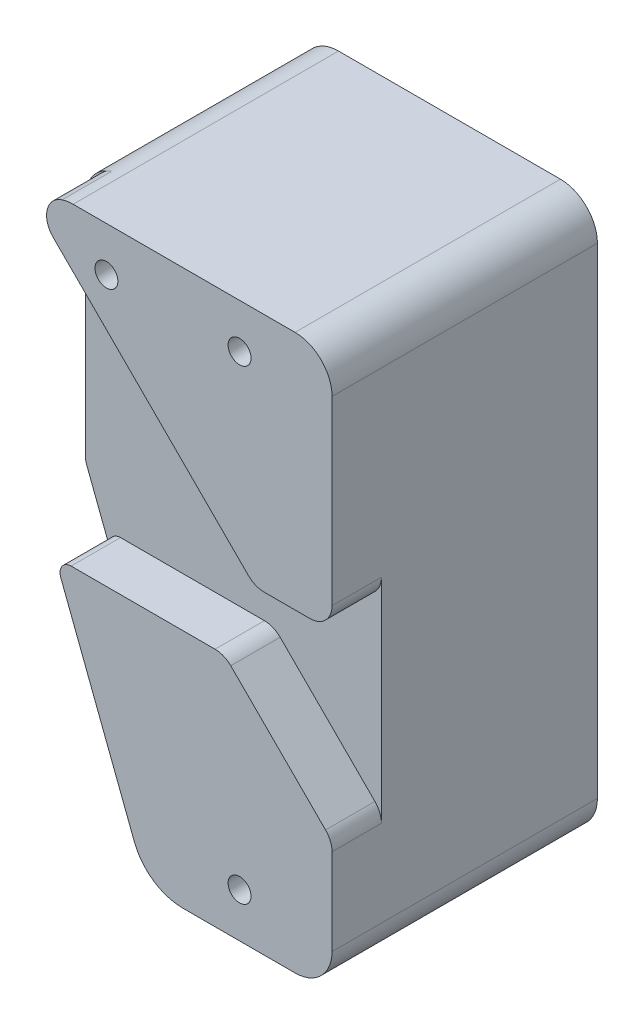
ISO-10303-21;
HEADER;
FILE_DESCRIPTION(('STEP AP214'),'2;1');
FILE_NAME('part.step','',(''),(''),'','','');
FILE_SCHEMA(('AUTOMOTIVE_DESIGN { 1 0 10303 214 1 1 1 1 }'));
ENDSEC;
DATA;
#1=APPLICATION_CONTEXT('core data for automotive mechanical design processes');
#2=APPLICATION_PROTOCOL_DEFINITION('international standard','automotive_design',2000,#1);
#3=PRODUCT_CONTEXT('',#1,'mechanical');
#4=PRODUCT('Part','Part','',(#3));
#5=PRODUCT_RELATED_PRODUCT_CATEGORY('part','',(#4));
#6=PRODUCT_DEFINITION_FORMATION('','',#4);
#7=PRODUCT_DEFINITION_CONTEXT('part definition',#1,'design');
#8=PRODUCT_DEFINITION('design','',#6,#7);
#9=PRODUCT_DEFINITION_SHAPE('','',#8);
#10=(LENGTH_UNIT() NAMED_UNIT(*) SI_UNIT(.MILLI.,.METRE.));
#11=(NAMED_UNIT(*) PLANE_ANGLE_UNIT() SI_UNIT($,.RADIAN.));
#12=(NAMED_UNIT(*) SI_UNIT($,.STERADIAN.) SOLID_ANGLE_UNIT());
#13=UNCERTAINTY_MEASURE_WITH_UNIT(LENGTH_MEASURE(1.E-05),#10,'distance_accuracy_value','');
#14=(GEOMETRIC_REPRESENTATION_CONTEXT(3) GLOBAL_UNCERTAINTY_ASSIGNED_CONTEXT((#13)) GLOBAL_UNIT_ASSIGNED_CONTEXT((#10,
#11,#12)) REPRESENTATION_CONTEXT('',''));
#15=CARTESIAN_POINT('',(0.,0.,0.));
#16=DIRECTION('',(0.,0.,1.));
#17=DIRECTION('',(1.,0.,0.));
#18=AXIS2_PLACEMENT_3D('',#15,#16,#17);
#19=CARTESIAN_POINT('',(-15.,0.,2.85));
#20=DIRECTION('',(1.,0.,0.));
#21=DIRECTION('',(0.,0.,-1.));
#22=AXIS2_PLACEMENT_3D('',#19,#20,#21);
#23=PLANE('',#22);
#24=DIRECTION('',(0.,-1.,0.));
#25=VECTOR('',#24,1.);
#26=CARTESIAN_POINT('',(-15.,0.,2.85));
#27=LINE('',#26,#25);
#28=CARTESIAN_POINT('',(-15.,70.,2.85000000000001));
#29=VERTEX_POINT('',#28);
#30=CARTESIAN_POINT('',(-15.,39.5,2.85));
#31=VERTEX_POINT('',#30);
#32=EDGE_CURVE('E335',#29,#31,#27,.T.);
#33=ORIENTED_EDGE('',*,*,#32,.F.);
#34=DIRECTION('',(0.,0.,-1.));
#35=VECTOR('',#34,1.);
#36=CARTESIAN_POINT('',(-15.,70.,2.85));
#37=LINE('',#36,#35);
#38=CARTESIAN_POINT('',(-15.,70.,-26.35));
#39=VERTEX_POINT('',#38);
#40=EDGE_CURVE('E341',#29,#39,#37,.T.);
#41=ORIENTED_EDGE('',*,*,#40,.T.);
#42=DIRECTION('',(0.,1.,0.));
#43=VECTOR('',#42,1.);
#44=CARTESIAN_POINT('',(-15.,39.5,-26.35));
#45=LINE('',#44,#43);
#46=CARTESIAN_POINT('',(-15.,39.5,-26.35));
#47=VERTEX_POINT('',#46);
#48=EDGE_CURVE('E240',#47,#39,#45,.T.);
#49=ORIENTED_EDGE('',*,*,#48,.F.);
#50=DIRECTION('',(0.,0.,-1.));
#51=VECTOR('',#50,1.);
#52=CARTESIAN_POINT('',(-15.,39.5,2.85));
#53=LINE('',#52,#51);
#54=EDGE_CURVE('E201',#47,#31,#53,.F.);
#55=ORIENTED_EDGE('',*,*,#54,.T.);
#56=EDGE_LOOP('',(#33,#41,#49,#55));
#57=FACE_BOUND('',#56,.T.);
#58=ADVANCED_FACE('F42',(#57),#23,.F.);
#59=CARTESIAN_POINT('',(0.,42.5,6.35));
#60=DIRECTION('',(0.,1.,0.));
#61=DIRECTION('',(-1.,0.,0.));
#62=AXIS2_PLACEMENT_3D('',#59,#60,#61);
#63=PLANE('',#62);
#64=DIRECTION('',(1.,0.,0.));
#65=VECTOR('',#64,1.);
#66=CARTESIAN_POINT('',(0.,42.5,2.85));
#67=LINE('',#66,#65);
#68=CARTESIAN_POINT('',(15.8137084989848,42.5,2.85));
#69=VERTEX_POINT('',#68);
#70=CARTESIAN_POINT('',(22.,42.5,2.85));
#71=VERTEX_POINT('',#70);
#72=EDGE_CURVE('E331',#69,#71,#67,.T.);
#73=ORIENTED_EDGE('',*,*,#72,.T.);
#74=DIRECTION('',(0.,0.,1.));
#75=VECTOR('',#74,1.);
#76=CARTESIAN_POINT('',(22.,42.5,6.35));
#77=LINE('',#76,#75);
#78=CARTESIAN_POINT('',(22.,42.5,9.525));
#79=VERTEX_POINT('',#78);
#80=EDGE_CURVE('E380',#71,#79,#77,.T.);
#81=ORIENTED_EDGE('',*,*,#80,.T.);
#82=DIRECTION('',(1.,0.,0.));
#83=VECTOR('',#82,1.);
#84=CARTESIAN_POINT('',(0.,42.5,9.525));
#85=LINE('',#84,#83);
#86=CARTESIAN_POINT('',(15.8137084989848,42.5,9.525));
#87=VERTEX_POINT('',#86);
#88=EDGE_CURVE('E323',#87,#79,#85,.T.);
#89=ORIENTED_EDGE('',*,*,#88,.F.);
#90=DIRECTION('',(0.,0.,-1.));
#91=VECTOR('',#90,1.);
#92=CARTESIAN_POINT('',(15.8137084989848,42.5,6.35));
#93=LINE('',#92,#91);
#94=EDGE_CURVE('E376',#87,#69,#93,.T.);
#95=ORIENTED_EDGE('',*,*,#94,.T.);
#96=EDGE_LOOP('',(#73,#81,#89,#95));
#97=FACE_BOUND('',#96,.T.);
#98=ADVANCED_FACE('F487',(#97),#63,.F.);
#99=CARTESIAN_POINT('',(0.,75.,2.85));
#100=DIRECTION('',(0.,-1.,0.));
#101=DIRECTION('',(0.,0.,-1.));
#102=AXIS2_PLACEMENT_3D('',#99,#100,#101);
#103=PLANE('',#102);
#104=DIRECTION('',(0.,0.,-1.));
#105=VECTOR('',#104,1.);
#106=CARTESIAN_POINT('',(20.,75.,2.85));
#107=LINE('',#106,#105);
#108=CARTESIAN_POINT('',(20.,75.,9.525));
#109=VERTEX_POINT('',#108);
#110=CARTESIAN_POINT('',(20.,75.,-26.35));
#111=VERTEX_POINT('',#110);
#112=EDGE_CURVE('E344',#109,#111,#107,.T.);
#113=ORIENTED_EDGE('',*,*,#112,.T.);
#114=DIRECTION('',(1.,0.,0.));
#115=VECTOR('',#114,1.);
#116=CARTESIAN_POINT('',(-10.,75.,-26.35));
#117=LINE('',#116,#115);
#118=CARTESIAN_POINT('',(-10.,75.,-26.35));
#119=VERTEX_POINT('',#118);
#120=EDGE_CURVE('E248',#119,#111,#117,.T.);
#121=ORIENTED_EDGE('',*,*,#120,.F.);
#122=DIRECTION('',(0.,0.,-1.));
#123=VECTOR('',#122,1.);
#124=CARTESIAN_POINT('',(-10.,75.,2.85));
#125=LINE('',#124,#123);
#126=CARTESIAN_POINT('',(-10.,75.,9.525));
#127=VERTEX_POINT('',#126);
#128=EDGE_CURVE('E347',#119,#127,#125,.F.);
#129=ORIENTED_EDGE('',*,*,#128,.T.);
#130=DIRECTION('',(-1.,0.,0.));
#131=VECTOR('',#130,1.);
#132=CARTESIAN_POINT('',(0.,75.,9.525));
#133=LINE('',#132,#131);
#134=EDGE_CURVE('E315',#109,#127,#133,.T.);
#135=ORIENTED_EDGE('',*,*,#134,.F.);
#136=EDGE_LOOP('',(#113,#121,#129,#135));
#137=FACE_BOUND('',#136,.T.);
#138=ADVANCED_FACE('F529',(#137),#103,.F.);
#139=CARTESIAN_POINT('',(0.,0.,2.85));
#140=DIRECTION('',(0.,1.,0.));
#141=DIRECTION('',(0.,0.,1.));
#142=AXIS2_PLACEMENT_3D('',#139,#140,#141);
#143=PLANE('',#142);
#144=DIRECTION('',(1.,0.,0.));
#145=VECTOR('',#144,1.);
#146=CARTESIAN_POINT('',(0.,0.,9.525));
#147=LINE('',#146,#145);
#148=CARTESIAN_POINT('',(4.81332293887137,0.,9.525));
#149=VERTEX_POINT('',#148);
#150=CARTESIAN_POINT('',(20.,0.,9.525));
#151=VERTEX_POINT('',#150);
#152=EDGE_CURVE('E299',#149,#151,#147,.T.);
#153=ORIENTED_EDGE('',*,*,#152,.F.);
#154=DIRECTION('',(0.,0.,-1.));
#155=VECTOR('',#154,1.);
#156=CARTESIAN_POINT('',(4.81332293887137,0.,-6.35));
#157=LINE('',#156,#155);
#158=CARTESIAN_POINT('',(4.81332293887137,0.,-26.35));
#159=VERTEX_POINT('',#158);
#160=EDGE_CURVE('E208',#149,#159,#157,.T.);
#161=ORIENTED_EDGE('',*,*,#160,.T.);
#162=DIRECTION('',(-1.,0.,0.));
#163=VECTOR('',#162,1.);
#164=CARTESIAN_POINT('',(20.,0.,-26.35));
#165=LINE('',#164,#163);
#166=CARTESIAN_POINT('',(20.,0.,-26.35));
#167=VERTEX_POINT('',#166);
#168=EDGE_CURVE('E205',#167,#159,#165,.T.);
#169=ORIENTED_EDGE('',*,*,#168,.F.);
#170=DIRECTION('',(0.,0.,-1.));
#171=VECTOR('',#170,1.);
#172=CARTESIAN_POINT('',(20.,0.,2.85));
#173=LINE('',#172,#171);
#174=EDGE_CURVE('E191',#167,#151,#173,.F.);
#175=ORIENTED_EDGE('',*,*,#174,.T.);
#176=EDGE_LOOP('',(#153,#161,#169,#175));
#177=FACE_BOUND('',#176,.T.);
#178=ADVANCED_FACE('F206',(#177),#143,.F.);
#179=CARTESIAN_POINT('',(25.,0.,2.85));
#180=DIRECTION('',(-1.,0.,0.));
#181=DIRECTION('',(0.,0.,1.));
#182=AXIS2_PLACEMENT_3D('',#179,#180,#181);
#183=PLANE('',#182);
#184=DIRECTION('',(0.,1.,0.));
#185=VECTOR('',#184,1.);
#186=CARTESIAN_POINT('',(25.,0.,9.525));
#187=LINE('',#186,#185);
#188=CARTESIAN_POINT('',(25.,45.5,9.525));
#189=VERTEX_POINT('',#188);
#190=CARTESIAN_POINT('',(25.,70.,9.525));
#191=VERTEX_POINT('',#190);
#192=EDGE_CURVE('E308',#189,#191,#187,.T.);
#193=ORIENTED_EDGE('',*,*,#192,.F.);
#194=DIRECTION('',(0.,0.,1.));
#195=VECTOR('',#194,1.);
#196=CARTESIAN_POINT('',(25.,45.5,2.85));
#197=LINE('',#196,#195);
#198=CARTESIAN_POINT('',(25.,45.5,2.85));
#199=VERTEX_POINT('',#198);
#200=EDGE_CURVE('E397',#189,#199,#197,.F.);
#201=ORIENTED_EDGE('',*,*,#200,.T.);
#202=DIRECTION('',(0.,1.,0.));
#203=VECTOR('',#202,1.);
#204=CARTESIAN_POINT('',(25.,0.,2.85));
#205=LINE('',#204,#203);
#206=CARTESIAN_POINT('',(25.,16.6862915010152,2.85));
#207=VERTEX_POINT('',#206);
#208=EDGE_CURVE('E338',#207,#199,#205,.T.);
#209=ORIENTED_EDGE('',*,*,#208,.F.);
#210=DIRECTION('',(0.,0.,1.));
#211=VECTOR('',#210,1.);
#212=CARTESIAN_POINT('',(25.,16.6862915010152,2.85));
#213=LINE('',#212,#211);
#214=CARTESIAN_POINT('',(25.,16.6862915010152,9.525));
#215=VERTEX_POINT('',#214);
#216=EDGE_CURVE('E393',#207,#215,#213,.T.);
#217=ORIENTED_EDGE('',*,*,#216,.T.);
#218=DIRECTION('',(0.,1.,0.));
#219=VECTOR('',#218,1.);
#220=CARTESIAN_POINT('',(25.,0.,9.525));
#221=LINE('',#220,#219);
#222=CARTESIAN_POINT('',(25.,5.,9.525));
#223=VERTEX_POINT('',#222);
#224=EDGE_CURVE('E304',#223,#215,#221,.T.);
#225=ORIENTED_EDGE('',*,*,#224,.F.);
#226=DIRECTION('',(0.,0.,-1.));
#227=VECTOR('',#226,1.);
#228=CARTESIAN_POINT('',(25.,5.,2.85));
#229=LINE('',#228,#227);
#230=CARTESIAN_POINT('',(25.,5.,-26.35));
#231=VERTEX_POINT('',#230);
#232=EDGE_CURVE('E202',#223,#231,#229,.T.);
#233=ORIENTED_EDGE('',*,*,#232,.T.);
#234=DIRECTION('',(0.,-1.,0.));
#235=VECTOR('',#234,1.);
#236=CARTESIAN_POINT('',(25.,70.,-26.35));
#237=LINE('',#236,#235);
#238=CARTESIAN_POINT('',(25.,70.,-26.35));
#239=VERTEX_POINT('',#238);
#240=EDGE_CURVE('E220',#239,#231,#237,.T.);
#241=ORIENTED_EDGE('',*,*,#240,.F.);
#242=DIRECTION('',(0.,0.,-1.));
#243=VECTOR('',#242,1.);
#244=CARTESIAN_POINT('',(25.,70.,2.85));
#245=LINE('',#244,#243);
#246=EDGE_CURVE('E350',#239,#191,#245,.F.);
#247=ORIENTED_EDGE('',*,*,#246,.T.);
#248=EDGE_LOOP('',(#193,#201,#209,#217,#225,#233,#241,#247));
#249=FACE_BOUND('',#248,.T.);
#250=ADVANCED_FACE('F481',(#249),#183,.F.);
#251=CARTESIAN_POINT('',(0.,0.,2.85));
#252=DIRECTION('',(0.,0.,1.));
#253=DIRECTION('',(1.,0.,0.));
#254=AXIS2_PLACEMENT_3D('',#251,#252,#253);
#255=PLANE('',#254);
#256=CARTESIAN_POINT('',(12.5,37.5,2.85));
#257=DIRECTION('',(0.,0.,1.));
#258=DIRECTION('',(1.,0.,0.));
#259=AXIS2_PLACEMENT_3D('',#256,#257,#258);
#260=CIRCLE('',#259,1.55);
#261=CARTESIAN_POINT('',(14.05,37.5,2.85));
#262=VERTEX_POINT('',#261);
#263=EDGE_CURVE('E269',#262,#262,#260,.T.);
#264=ORIENTED_EDGE('',*,*,#263,.F.);
#265=EDGE_LOOP('',(#264));
#266=FACE_BOUND('',#265,.T.);
#267=DIRECTION('',(-0.35794111613384,0.933744160560515,0.));
#268=VECTOR('',#267,1.);
#269=CARTESIAN_POINT('',(0.,0.,2.85));
#270=LINE('',#269,#268);
#271=CARTESIAN_POINT('',(-11.6777081954385,30.4630883257992,2.85));
#272=VERTEX_POINT('',#271);
#273=CARTESIAN_POINT('',(-14.867488321121,38.7841177677323,2.85));
#274=VERTEX_POINT('',#273);
#275=EDGE_CURVE('E57',#272,#274,#270,.T.);
#276=ORIENTED_EDGE('',*,*,#275,.F.);
#277=CARTESIAN_POINT('',(-10.2770919545977,31.,2.85));
#278=DIRECTION('',(0.,0.,1.));
#279=DIRECTION('',(1.,0.,0.));
#280=AXIS2_PLACEMENT_3D('',#277,#278,#279);
#281=CIRCLE('',#280,1.5);
#282=CARTESIAN_POINT('',(-10.2770919545977,32.5,2.85));
#283=VERTEX_POINT('',#282);
#284=EDGE_CURVE('E12',#272,#283,#281,.F.);
#285=ORIENTED_EDGE('',*,*,#284,.T.);
#286=DIRECTION('',(-1.,0.,0.));
#287=VECTOR('',#286,1.);
#288=CARTESIAN_POINT('',(0.,32.5,2.85));
#289=LINE('',#288,#287);
#290=CARTESIAN_POINT('',(9.18629150101523,32.5,2.85));
#291=VERTEX_POINT('',#290);
#292=EDGE_CURVE('E327',#291,#283,#289,.T.);
#293=ORIENTED_EDGE('',*,*,#292,.F.);
#294=CARTESIAN_POINT('',(9.18629150101523,29.5,2.85));
#295=DIRECTION('',(0.,0.,1.));
#296=DIRECTION('',(1.,0.,0.));
#297=AXIS2_PLACEMENT_3D('',#294,#295,#296);
#298=CIRCLE('',#297,3.);
#299=CARTESIAN_POINT('',(11.3076118445749,31.6213203435596,2.85000000000001));
#300=VERTEX_POINT('',#299);
#301=EDGE_CURVE('E434',#291,#300,#298,.F.);
#302=ORIENTED_EDGE('',*,*,#301,.T.);
#303=DIRECTION('',(-0.707106781186547,0.707106781186548,0.));
#304=VECTOR('',#303,1.);
#305=CARTESIAN_POINT('',(21.4644660940673,21.4644660940672,2.85000000000001));
#306=LINE('',#305,#304);
#307=CARTESIAN_POINT('',(24.1213203435596,18.8076118445749,2.85000000000001));
#308=VERTEX_POINT('',#307);
#309=EDGE_CURVE('E292',#308,#300,#306,.T.);
#310=ORIENTED_EDGE('',*,*,#309,.F.);
#311=CARTESIAN_POINT('',(22.,16.6862915010152,2.85));
#312=DIRECTION('',(0.,0.,1.));
#313=DIRECTION('',(1.,0.,0.));
#314=AXIS2_PLACEMENT_3D('',#311,#312,#313);
#315=CIRCLE('',#314,3.);
#316=EDGE_CURVE('E430',#308,#207,#315,.F.);
#317=ORIENTED_EDGE('',*,*,#316,.T.);
#318=ORIENTED_EDGE('',*,*,#208,.T.);
#319=CARTESIAN_POINT('',(22.,45.5,2.85));
#320=DIRECTION('',(0.,0.,1.));
#321=DIRECTION('',(1.,0.,0.));
#322=AXIS2_PLACEMENT_3D('',#319,#320,#321);
#323=CIRCLE('',#322,3.);
#324=EDGE_CURVE('E427',#199,#71,#323,.F.);
#325=ORIENTED_EDGE('',*,*,#324,.T.);
#326=ORIENTED_EDGE('',*,*,#72,.F.);
#327=CARTESIAN_POINT('',(15.8137084989848,45.5,2.85));
#328=DIRECTION('',(0.,0.,1.));
#329=DIRECTION('',(1.,0.,0.));
#330=AXIS2_PLACEMENT_3D('',#327,#328,#329);
#331=CIRCLE('',#330,3.);
#332=CARTESIAN_POINT('',(13.6923881554251,43.3786796564404,2.85000000000001));
#333=VERTEX_POINT('',#332);
#334=EDGE_CURVE('E437',#69,#333,#331,.F.);
#335=ORIENTED_EDGE('',*,*,#334,.T.);
#336=DIRECTION('',(0.707106781186548,-0.707106781186548,0.));
#337=VECTOR('',#336,1.);
#338=CARTESIAN_POINT('',(28.5355339059327,28.5355339059327,2.85000000000001));
#339=LINE('',#338,#337);
#340=CARTESIAN_POINT('',(-12.7168807597926,69.787948571658,2.85000000000001));
#341=VERTEX_POINT('',#340);
#342=EDGE_CURVE('E285',#341,#333,#339,.T.);
#343=ORIENTED_EDGE('',*,*,#342,.F.);
#344=CARTESIAN_POINT('',(-10.5955604162329,71.9092689152177,2.85));
#345=DIRECTION('',(0.,0.,1.));
#346=DIRECTION('',(1.,0.,0.));
#347=AXIS2_PLACEMENT_3D('',#344,#345,#346);
#348=CIRCLE('',#347,3.);
#349=CARTESIAN_POINT('',(-11.4889010405823,74.7731722880442,2.85000000000001));
#350=VERTEX_POINT('',#349);
#351=EDGE_CURVE('E440',#341,#350,#348,.F.);
#352=ORIENTED_EDGE('',*,*,#351,.T.);
#353=CARTESIAN_POINT('',(-10.,70.,2.85000000000001));
#354=DIRECTION('',(0.,0.,1.));
#355=DIRECTION('',(1.,0.,0.));
#356=AXIS2_PLACEMENT_3D('',#353,#354,#355);
#357=CIRCLE('',#356,5.);
#358=EDGE_CURVE('E289',#29,#350,#357,.F.);
#359=ORIENTED_EDGE('',*,*,#358,.F.);
#360=ORIENTED_EDGE('',*,*,#32,.T.);
#361=CARTESIAN_POINT('',(-13.,39.5,2.85));
#362=DIRECTION('',(0.,0.,1.));
#363=DIRECTION('',(1.,0.,0.));
#364=AXIS2_PLACEMENT_3D('',#361,#362,#363);
#365=CIRCLE('',#364,2.);
#366=EDGE_CURVE('E359',#31,#274,#365,.T.);
#367=ORIENTED_EDGE('',*,*,#366,.T.);
#368=EDGE_LOOP('',(#276,#285,#293,#302,#310,#317,#318,#325,#326,#335,#343,#352,#359,#360,#367));
#369=FACE_BOUND('',#368,.T.);
#370=ADVANCED_FACE('F458',(#266,#369),#255,.T.);
#371=CARTESIAN_POINT('',(-10.,70.,2.85));
#372=DIRECTION('',(0.,0.,-1.));
#373=DIRECTION('',(-1.,0.,0.));
#374=AXIS2_PLACEMENT_3D('',#371,#372,#373);
#375=CYLINDRICAL_SURFACE('',#374,5.);
#376=ORIENTED_EDGE('',*,*,#358,.T.);
#377=DIRECTION('',(0.,0.,-1.));
#378=VECTOR('',#377,1.);
#379=CARTESIAN_POINT('',(-11.4889010405823,74.7731722880442,2.85));
#380=LINE('',#379,#378);
#381=CARTESIAN_POINT('',(-11.4889010405823,74.7731722880442,9.525));
#382=VERTEX_POINT('',#381);
#383=EDGE_CURVE('E423',#350,#382,#380,.F.);
#384=ORIENTED_EDGE('',*,*,#383,.T.);
#385=CARTESIAN_POINT('',(-10.,70.,9.525));
#386=DIRECTION('',(0.,0.,1.));
#387=DIRECTION('',(1.,0.,0.));
#388=AXIS2_PLACEMENT_3D('',#385,#386,#387);
#389=CIRCLE('',#388,5.);
#390=EDGE_CURVE('E319',#127,#382,#389,.T.);
#391=ORIENTED_EDGE('',*,*,#390,.F.);
#392=ORIENTED_EDGE('',*,*,#128,.F.);
#393=CARTESIAN_POINT('',(-10.,70.,-26.35));
#394=DIRECTION('',(0.,0.,-1.));
#395=DIRECTION('',(-1.,0.,0.));
#396=AXIS2_PLACEMENT_3D('',#393,#394,#395);
#397=CIRCLE('',#396,5.);
#398=EDGE_CURVE('E244',#39,#119,#397,.T.);
#399=ORIENTED_EDGE('',*,*,#398,.F.);
#400=ORIENTED_EDGE('',*,*,#40,.F.);
#401=EDGE_LOOP('',(#376,#384,#391,#392,#399,#400));
#402=FACE_BOUND('',#401,.T.);
#403=ADVANCED_FACE('F508',(#402),#375,.T.);
#404=CARTESIAN_POINT('',(20.,5.,2.85));
#405=DIRECTION('',(0.,0.,-1.));
#406=DIRECTION('',(-1.,0.,0.));
#407=AXIS2_PLACEMENT_3D('',#404,#405,#406);
#408=CYLINDRICAL_SURFACE('',#407,5.);
#409=ORIENTED_EDGE('',*,*,#232,.F.);
#410=CARTESIAN_POINT('',(20.,5.,9.525));
#411=DIRECTION('',(0.,0.,1.));
#412=DIRECTION('',(1.,0.,0.));
#413=AXIS2_PLACEMENT_3D('',#410,#411,#412);
#414=CIRCLE('',#413,5.);
#415=EDGE_CURVE('E197',#151,#223,#414,.T.);
#416=ORIENTED_EDGE('',*,*,#415,.F.);
#417=ORIENTED_EDGE('',*,*,#174,.F.);
#418=CARTESIAN_POINT('',(20.,5.,-26.35));
#419=DIRECTION('',(0.,0.,-1.));
#420=DIRECTION('',(-1.,0.,0.));
#421=AXIS2_PLACEMENT_3D('',#418,#419,#420);
#422=CIRCLE('',#421,5.);
#423=EDGE_CURVE('E195',#231,#167,#422,.T.);
#424=ORIENTED_EDGE('',*,*,#423,.F.);
#425=EDGE_LOOP('',(#409,#416,#417,#424));
#426=FACE_BOUND('',#425,.T.);
#427=ADVANCED_FACE('F193',(#426),#408,.T.);
#428=CARTESIAN_POINT('',(20.,70.,2.85));
#429=DIRECTION('',(0.,0.,-1.));
#430=DIRECTION('',(-1.,0.,0.));
#431=AXIS2_PLACEMENT_3D('',#428,#429,#430);
#432=CYLINDRICAL_SURFACE('',#431,5.);
#433=ORIENTED_EDGE('',*,*,#112,.F.);
#434=CARTESIAN_POINT('',(20.,70.,9.525));
#435=DIRECTION('',(0.,0.,1.));
#436=DIRECTION('',(1.,0.,0.));
#437=AXIS2_PLACEMENT_3D('',#434,#435,#436);
#438=CIRCLE('',#437,5.);
#439=EDGE_CURVE('E311',#191,#109,#438,.T.);
#440=ORIENTED_EDGE('',*,*,#439,.F.);
#441=ORIENTED_EDGE('',*,*,#246,.F.);
#442=CARTESIAN_POINT('',(20.,70.,-26.35));
#443=DIRECTION('',(0.,0.,-1.));
#444=DIRECTION('',(-1.,0.,0.));
#445=AXIS2_PLACEMENT_3D('',#442,#443,#444);
#446=CIRCLE('',#445,5.);
#447=EDGE_CURVE('E252',#111,#239,#446,.T.);
#448=ORIENTED_EDGE('',*,*,#447,.F.);
#449=EDGE_LOOP('',(#433,#440,#441,#448));
#450=FACE_BOUND('',#449,.T.);
#451=ADVANCED_FACE('F525',(#450),#432,.T.);
#452=CARTESIAN_POINT('',(-13.,39.5,2.85));
#453=DIRECTION('',(0.,0.,1.));
#454=DIRECTION('',(1.,0.,0.));
#455=AXIS2_PLACEMENT_3D('',#452,#453,#454);
#456=CYLINDRICAL_SURFACE('',#455,2.);
#457=DIRECTION('',(0.,0.,-1.));
#458=VECTOR('',#457,1.);
#459=CARTESIAN_POINT('',(-14.867488321121,38.7841177677323,46.4266552549781));
#460=LINE('',#459,#458);
#461=CARTESIAN_POINT('',(-14.867488321121,38.7841177677323,-26.35));
#462=VERTEX_POINT('',#461);
#463=EDGE_CURVE('E282',#274,#462,#460,.T.);
#464=ORIENTED_EDGE('',*,*,#463,.F.);
#465=ORIENTED_EDGE('',*,*,#366,.F.);
#466=ORIENTED_EDGE('',*,*,#54,.F.);
#467=CARTESIAN_POINT('',(-13.,39.5,-26.35));
#468=DIRECTION('',(0.,0.,-1.));
#469=DIRECTION('',(-1.,0.,0.));
#470=AXIS2_PLACEMENT_3D('',#467,#468,#469);
#471=CIRCLE('',#470,2.);
#472=EDGE_CURVE('E236',#462,#47,#471,.T.);
#473=ORIENTED_EDGE('',*,*,#472,.F.);
#474=EDGE_LOOP('',(#464,#465,#466,#473));
#475=FACE_BOUND('',#474,.T.);
#476=ADVANCED_FACE('F515',(#475),#456,.T.);
#477=CARTESIAN_POINT('',(0.,32.5,6.35));
#478=DIRECTION('',(0.,-1.,0.));
#479=DIRECTION('',(0.,0.,-1.));
#480=AXIS2_PLACEMENT_3D('',#477,#478,#479);
#481=PLANE('',#480);
#482=ORIENTED_EDGE('',*,*,#292,.T.);
#483=DIRECTION('',(0.,0.,1.));
#484=VECTOR('',#483,1.);
#485=CARTESIAN_POINT('',(-10.2770919545977,32.5,9.525));
#486=LINE('',#485,#484);
#487=CARTESIAN_POINT('',(-10.2770919545977,32.5,9.525));
#488=VERTEX_POINT('',#487);
#489=EDGE_CURVE('E444',#283,#488,#486,.T.);
#490=ORIENTED_EDGE('',*,*,#489,.T.);
#491=DIRECTION('',(-1.,0.,0.));
#492=VECTOR('',#491,1.);
#493=CARTESIAN_POINT('',(0.,32.5,9.525));
#494=LINE('',#493,#492);
#495=CARTESIAN_POINT('',(9.18629150101523,32.5,9.525));
#496=VERTEX_POINT('',#495);
#497=EDGE_CURVE('E296',#496,#488,#494,.T.);
#498=ORIENTED_EDGE('',*,*,#497,.F.);
#499=DIRECTION('',(0.,0.,-1.));
#500=VECTOR('',#499,1.);
#501=CARTESIAN_POINT('',(9.18629150101523,32.5,6.35));
#502=LINE('',#501,#500);
#503=EDGE_CURVE('E413',#496,#291,#502,.T.);
#504=ORIENTED_EDGE('',*,*,#503,.T.);
#505=EDGE_LOOP('',(#482,#490,#498,#504));
#506=FACE_BOUND('',#505,.T.);
#507=ADVANCED_FACE('F460',(#506),#481,.F.);
#508=CARTESIAN_POINT('',(0.,0.,9.525));
#509=DIRECTION('',(0.,0.,1.));
#510=DIRECTION('',(1.,0.,0.));
#511=AXIS2_PLACEMENT_3D('',#508,#509,#510);
#512=PLANE('',#511);
#513=CARTESIAN_POINT('',(-5.50000000000001,69.,9.525));
#514=DIRECTION('',(0.,0.,-1.));
#515=DIRECTION('',(-1.,0.,0.));
#516=AXIS2_PLACEMENT_3D('',#513,#514,#515);
#517=CIRCLE('',#516,1.55);
#518=CARTESIAN_POINT('',(-7.05000000000001,69.,9.525));
#519=VERTEX_POINT('',#518);
#520=EDGE_CURVE('E258',#519,#519,#517,.T.);
#521=ORIENTED_EDGE('',*,*,#520,.T.);
#522=EDGE_LOOP('',(#521));
#523=FACE_BOUND('',#522,.T.);
#524=CARTESIAN_POINT('',(12.5,69.,9.525));
#525=DIRECTION('',(0.,0.,-1.));
#526=DIRECTION('',(-1.,0.,0.));
#527=AXIS2_PLACEMENT_3D('',#524,#525,#526);
#528=CIRCLE('',#527,1.55);
#529=CARTESIAN_POINT('',(10.95,69.,9.525));
#530=VERTEX_POINT('',#529);
#531=EDGE_CURVE('E262',#530,#530,#528,.T.);
#532=ORIENTED_EDGE('',*,*,#531,.T.);
#533=EDGE_LOOP('',(#532));
#534=FACE_BOUND('',#533,.T.);
#535=ORIENTED_EDGE('',*,*,#88,.T.);
#536=CARTESIAN_POINT('',(22.,45.5,9.525));
#537=DIRECTION('',(0.,0.,1.));
#538=DIRECTION('',(1.,0.,0.));
#539=AXIS2_PLACEMENT_3D('',#536,#537,#538);
#540=CIRCLE('',#539,3.);
#541=EDGE_CURVE('E390',#79,#189,#540,.T.);
#542=ORIENTED_EDGE('',*,*,#541,.T.);
#543=ORIENTED_EDGE('',*,*,#192,.T.);
#544=ORIENTED_EDGE('',*,*,#439,.T.);
#545=ORIENTED_EDGE('',*,*,#134,.T.);
#546=ORIENTED_EDGE('',*,*,#390,.T.);
#547=CARTESIAN_POINT('',(-10.5955604162329,71.9092689152177,9.525));
#548=DIRECTION('',(0.,0.,1.));
#549=DIRECTION('',(1.,0.,0.));
#550=AXIS2_PLACEMENT_3D('',#547,#548,#549);
#551=CIRCLE('',#550,3.);
#552=CARTESIAN_POINT('',(-12.7168807597926,69.787948571658,9.525));
#553=VERTEX_POINT('',#552);
#554=EDGE_CURVE('E384',#382,#553,#551,.T.);
#555=ORIENTED_EDGE('',*,*,#554,.T.);
#556=DIRECTION('',(-0.707106781186548,0.707106781186548,0.));
#557=VECTOR('',#556,1.);
#558=CARTESIAN_POINT('',(28.5355339059327,28.5355339059327,9.525));
#559=LINE('',#558,#557);
#560=CARTESIAN_POINT('',(13.6923881554251,43.3786796564404,9.525));
#561=VERTEX_POINT('',#560);
#562=EDGE_CURVE('E366',#561,#553,#559,.T.);
#563=ORIENTED_EDGE('',*,*,#562,.F.);
#564=CARTESIAN_POINT('',(15.8137084989848,45.5,9.525));
#565=DIRECTION('',(0.,0.,1.));
#566=DIRECTION('',(1.,0.,0.));
#567=AXIS2_PLACEMENT_3D('',#564,#565,#566);
#568=CIRCLE('',#567,3.);
#569=EDGE_CURVE('E387',#561,#87,#568,.T.);
#570=ORIENTED_EDGE('',*,*,#569,.T.);
#571=EDGE_LOOP('',(#535,#542,#543,#544,#545,#546,#555,#563,#570));
#572=FACE_BOUND('',#571,.T.);
#573=ADVANCED_FACE('F490',(#523,#534,#572),#512,.T.);
#574=CARTESIAN_POINT('',(0.,0.,9.525));
#575=DIRECTION('',(0.,0.,1.));
#576=DIRECTION('',(1.,0.,0.));
#577=AXIS2_PLACEMENT_3D('',#574,#575,#576);
#578=PLANE('',#577);
#579=CARTESIAN_POINT('',(12.5,6.,9.525));
#580=DIRECTION('',(0.,0.,-1.));
#581=DIRECTION('',(-1.,0.,0.));
#582=AXIS2_PLACEMENT_3D('',#579,#580,#581);
#583=CIRCLE('',#582,1.55);
#584=CARTESIAN_POINT('',(10.95,6.,9.525));
#585=VERTEX_POINT('',#584);
#586=EDGE_CURVE('E257',#585,#585,#583,.T.);
#587=ORIENTED_EDGE('',*,*,#586,.T.);
#588=EDGE_LOOP('',(#587));
#589=FACE_BOUND('',#588,.T.);
#590=ORIENTED_EDGE('',*,*,#497,.T.);
#591=CARTESIAN_POINT('',(-10.2770919545977,31.,9.525));
#592=DIRECTION('',(0.,0.,1.));
#593=DIRECTION('',(1.,0.,0.));
#594=AXIS2_PLACEMENT_3D('',#591,#592,#593);
#595=CIRCLE('',#594,1.5);
#596=CARTESIAN_POINT('',(-11.6777081954385,30.4630883257992,9.525));
#597=VERTEX_POINT('',#596);
#598=EDGE_CURVE('E65',#488,#597,#595,.T.);
#599=ORIENTED_EDGE('',*,*,#598,.T.);
#600=DIRECTION('',(0.35794111613384,-0.933744160560515,0.));
#601=VECTOR('',#600,1.);
#602=CARTESIAN_POINT('',(-1.72288618505223,4.49441218706312,9.525));
#603=LINE('',#602,#601);
#604=CARTESIAN_POINT('',(-1.72288618505224,4.49441218706312,9.525));
#605=VERTEX_POINT('',#604);
#606=EDGE_CURVE('E273',#597,#605,#603,.T.);
#607=ORIENTED_EDGE('',*,*,#606,.T.);
#608=CARTESIAN_POINT('',(4.81332293887137,7.,9.525));
#609=DIRECTION('',(0.,0.,1.));
#610=DIRECTION('',(1.,0.,0.));
#611=AXIS2_PLACEMENT_3D('',#608,#609,#610);
#612=CIRCLE('',#611,7.);
#613=EDGE_CURVE('E276',#605,#149,#612,.T.);
#614=ORIENTED_EDGE('',*,*,#613,.T.);
#615=ORIENTED_EDGE('',*,*,#152,.T.);
#616=ORIENTED_EDGE('',*,*,#415,.T.);
#617=ORIENTED_EDGE('',*,*,#224,.T.);
#618=CARTESIAN_POINT('',(22.,16.6862915010152,9.525));
#619=DIRECTION('',(0.,0.,1.));
#620=DIRECTION('',(1.,0.,0.));
#621=AXIS2_PLACEMENT_3D('',#618,#619,#620);
#622=CIRCLE('',#621,3.);
#623=CARTESIAN_POINT('',(24.1213203435596,18.8076118445749,9.525));
#624=VERTEX_POINT('',#623);
#625=EDGE_CURVE('E404',#215,#624,#622,.T.);
#626=ORIENTED_EDGE('',*,*,#625,.T.);
#627=DIRECTION('',(0.707106781186547,-0.707106781186548,0.));
#628=VECTOR('',#627,1.);
#629=CARTESIAN_POINT('',(21.4644660940673,21.4644660940672,9.525));
#630=LINE('',#629,#628);
#631=CARTESIAN_POINT('',(11.3076118445749,31.6213203435596,9.525));
#632=VERTEX_POINT('',#631);
#633=EDGE_CURVE('E362',#632,#624,#630,.T.);
#634=ORIENTED_EDGE('',*,*,#633,.F.);
#635=CARTESIAN_POINT('',(9.18629150101523,29.5,9.525));
#636=DIRECTION('',(0.,0.,1.));
#637=DIRECTION('',(1.,0.,0.));
#638=AXIS2_PLACEMENT_3D('',#635,#636,#637);
#639=CIRCLE('',#638,3.);
#640=EDGE_CURVE('E401',#632,#496,#639,.T.);
#641=ORIENTED_EDGE('',*,*,#640,.T.);
#642=EDGE_LOOP('',(#590,#599,#607,#614,#615,#616,#617,#626,#634,#641));
#643=FACE_BOUND('',#642,.T.);
#644=ADVANCED_FACE('F520',(#589,#643),#578,.T.);
#645=CARTESIAN_POINT('',(21.4644660940673,21.4644660940672,-64.4778780974998));
#646=DIRECTION('',(-0.707106781186548,-0.707106781186547,0.));
#647=DIRECTION('',(0.707106781186547,-0.707106781186548,0.));
#648=AXIS2_PLACEMENT_3D('',#645,#646,#647);
#649=PLANE('',#648);
#650=ORIENTED_EDGE('',*,*,#633,.T.);
#651=DIRECTION('',(0.,0.,1.));
#652=VECTOR('',#651,1.);
#653=CARTESIAN_POINT('',(24.1213203435596,18.8076118445749,-64.4778780974998));
#654=LINE('',#653,#652);
#655=EDGE_CURVE('E410',#624,#308,#654,.F.);
#656=ORIENTED_EDGE('',*,*,#655,.T.);
#657=ORIENTED_EDGE('',*,*,#309,.T.);
#658=DIRECTION('',(0.,0.,-1.));
#659=VECTOR('',#658,1.);
#660=CARTESIAN_POINT('',(11.3076118445749,31.6213203435596,-64.4778780974998));
#661=LINE('',#660,#659);
#662=EDGE_CURVE('E407',#300,#632,#661,.F.);
#663=ORIENTED_EDGE('',*,*,#662,.T.);
#664=EDGE_LOOP('',(#650,#656,#657,#663));
#665=FACE_BOUND('',#664,.T.);
#666=ADVANCED_FACE('F470',(#665),#649,.F.);
#667=CARTESIAN_POINT('',(28.5355339059327,28.5355339059327,-64.4778780974998));
#668=DIRECTION('',(0.707106781186548,0.707106781186548,0.));
#669=DIRECTION('',(-0.707106781186548,0.707106781186548,0.));
#670=AXIS2_PLACEMENT_3D('',#667,#668,#669);
#671=PLANE('',#670);
#672=ORIENTED_EDGE('',*,*,#342,.T.);
#673=DIRECTION('',(0.,0.,-1.));
#674=VECTOR('',#673,1.);
#675=CARTESIAN_POINT('',(13.6923881554251,43.3786796564404,-64.4778780974998));
#676=LINE('',#675,#674);
#677=EDGE_CURVE('E420',#333,#561,#676,.F.);
#678=ORIENTED_EDGE('',*,*,#677,.T.);
#679=ORIENTED_EDGE('',*,*,#562,.T.);
#680=DIRECTION('',(0.,0.,1.));
#681=VECTOR('',#680,1.);
#682=CARTESIAN_POINT('',(-12.7168807597925,69.787948571658,2.85000000000001));
#683=LINE('',#682,#681);
#684=EDGE_CURVE('E417',#553,#341,#683,.F.);
#685=ORIENTED_EDGE('',*,*,#684,.T.);
#686=EDGE_LOOP('',(#672,#678,#679,#685));
#687=FACE_BOUND('',#686,.T.);
#688=ADVANCED_FACE('F499',(#687),#671,.F.);
#689=CARTESIAN_POINT('',(0.,0.,46.4266552549781));
#690=DIRECTION('',(-0.933744160560515,-0.35794111613384,0.));
#691=DIRECTION('',(0.35794111613384,-0.933744160560515,0.));
#692=AXIS2_PLACEMENT_3D('',#689,#690,#691);
#693=PLANE('',#692);
#694=ORIENTED_EDGE('',*,*,#606,.F.);
#695=DIRECTION('',(0.,0.,1.));
#696=VECTOR('',#695,1.);
#697=CARTESIAN_POINT('',(-11.6777081954385,30.4630883257992,2.85));
#698=LINE('',#697,#696);
#699=EDGE_CURVE('E51',#597,#272,#698,.F.);
#700=ORIENTED_EDGE('',*,*,#699,.T.);
#701=ORIENTED_EDGE('',*,*,#275,.T.);
#702=ORIENTED_EDGE('',*,*,#463,.T.);
#703=DIRECTION('',(-0.35794111613384,0.933744160560515,0.));
#704=VECTOR('',#703,1.);
#705=CARTESIAN_POINT('',(-1.72288618505223,4.49441218706311,-26.35));
#706=LINE('',#705,#704);
#707=CARTESIAN_POINT('',(-1.72288618505223,4.49441218706311,-26.35));
#708=VERTEX_POINT('',#707);
#709=EDGE_CURVE('E232',#708,#462,#706,.T.);
#710=ORIENTED_EDGE('',*,*,#709,.F.);
#711=DIRECTION('',(0.,0.,-1.));
#712=VECTOR('',#711,1.);
#713=CARTESIAN_POINT('',(-1.72288618505223,4.49441218706312,2.85));
#714=LINE('',#713,#712);
#715=EDGE_CURVE('E372',#708,#605,#714,.F.);
#716=ORIENTED_EDGE('',*,*,#715,.T.);
#717=EDGE_LOOP('',(#694,#700,#701,#702,#710,#716));
#718=FACE_BOUND('',#717,.T.);
#719=ADVANCED_FACE('F453',(#718),#693,.T.);
#720=CARTESIAN_POINT('',(4.81332293887137,7.,2.85));
#721=DIRECTION('',(0.,0.,1.));
#722=DIRECTION('',(1.,0.,0.));
#723=AXIS2_PLACEMENT_3D('',#720,#721,#722);
#724=CYLINDRICAL_SURFACE('',#723,7.);
#725=ORIENTED_EDGE('',*,*,#160,.F.);
#726=ORIENTED_EDGE('',*,*,#613,.F.);
#727=ORIENTED_EDGE('',*,*,#715,.F.);
#728=CARTESIAN_POINT('',(4.81332293887137,7.,-26.35));
#729=DIRECTION('',(0.,0.,-1.));
#730=DIRECTION('',(-1.,0.,0.));
#731=AXIS2_PLACEMENT_3D('',#728,#729,#730);
#732=CIRCLE('',#731,7.);
#733=EDGE_CURVE('E213',#159,#708,#732,.T.);
#734=ORIENTED_EDGE('',*,*,#733,.F.);
#735=EDGE_LOOP('',(#725,#726,#727,#734));
#736=FACE_BOUND('',#735,.T.);
#737=ADVANCED_FACE('F519',(#736),#724,.T.);
#738=CARTESIAN_POINT('',(22.,45.5,6.35));
#739=DIRECTION('',(0.,0.,1.));
#740=DIRECTION('',(1.,0.,0.));
#741=AXIS2_PLACEMENT_3D('',#738,#739,#740);
#742=CYLINDRICAL_SURFACE('',#741,3.);
#743=ORIENTED_EDGE('',*,*,#324,.F.);
#744=ORIENTED_EDGE('',*,*,#200,.F.);
#745=ORIENTED_EDGE('',*,*,#541,.F.);
#746=ORIENTED_EDGE('',*,*,#80,.F.);
#747=EDGE_LOOP('',(#743,#744,#745,#746));
#748=FACE_BOUND('',#747,.T.);
#749=ADVANCED_FACE('F484',(#748),#742,.T.);
#750=CARTESIAN_POINT('',(22.,16.6862915010152,2.85));
#751=DIRECTION('',(0.,0.,1.));
#752=DIRECTION('',(1.,0.,0.));
#753=AXIS2_PLACEMENT_3D('',#750,#751,#752);
#754=CYLINDRICAL_SURFACE('',#753,3.);
#755=ORIENTED_EDGE('',*,*,#316,.F.);
#756=ORIENTED_EDGE('',*,*,#655,.F.);
#757=ORIENTED_EDGE('',*,*,#625,.F.);
#758=ORIENTED_EDGE('',*,*,#216,.F.);
#759=EDGE_LOOP('',(#755,#756,#757,#758));
#760=FACE_BOUND('',#759,.T.);
#761=ADVANCED_FACE('F474',(#760),#754,.T.);
#762=CARTESIAN_POINT('',(9.18629150101523,29.5,6.35));
#763=DIRECTION('',(0.,0.,-1.));
#764=DIRECTION('',(-1.,0.,0.));
#765=AXIS2_PLACEMENT_3D('',#762,#763,#764);
#766=CYLINDRICAL_SURFACE('',#765,3.);
#767=ORIENTED_EDGE('',*,*,#640,.F.);
#768=ORIENTED_EDGE('',*,*,#662,.F.);
#769=ORIENTED_EDGE('',*,*,#301,.F.);
#770=ORIENTED_EDGE('',*,*,#503,.F.);
#771=EDGE_LOOP('',(#767,#768,#769,#770));
#772=FACE_BOUND('',#771,.T.);
#773=ADVANCED_FACE('F465',(#772),#766,.T.);
#774=CARTESIAN_POINT('',(15.8137084989848,45.5,6.35));
#775=DIRECTION('',(0.,0.,-1.));
#776=DIRECTION('',(-1.,0.,0.));
#777=AXIS2_PLACEMENT_3D('',#774,#775,#776);
#778=CYLINDRICAL_SURFACE('',#777,3.);
#779=ORIENTED_EDGE('',*,*,#569,.F.);
#780=ORIENTED_EDGE('',*,*,#677,.F.);
#781=ORIENTED_EDGE('',*,*,#334,.F.);
#782=ORIENTED_EDGE('',*,*,#94,.F.);
#783=EDGE_LOOP('',(#779,#780,#781,#782));
#784=FACE_BOUND('',#783,.T.);
#785=ADVANCED_FACE('F495',(#784),#778,.T.);
#786=CARTESIAN_POINT('',(-10.5955604162329,71.9092689152177,2.85));
#787=DIRECTION('',(0.,0.,-1.));
#788=DIRECTION('',(-1.,0.,0.));
#789=AXIS2_PLACEMENT_3D('',#786,#787,#788);
#790=CYLINDRICAL_SURFACE('',#789,3.);
#791=ORIENTED_EDGE('',*,*,#351,.F.);
#792=ORIENTED_EDGE('',*,*,#684,.F.);
#793=ORIENTED_EDGE('',*,*,#554,.F.);
#794=ORIENTED_EDGE('',*,*,#383,.F.);
#795=EDGE_LOOP('',(#791,#792,#793,#794));
#796=FACE_BOUND('',#795,.T.);
#797=ADVANCED_FACE('F502',(#796),#790,.T.);
#798=CARTESIAN_POINT('',(-10.2770919545977,31.,6.35));
#799=DIRECTION('',(0.,0.,-1.));
#800=DIRECTION('',(-1.,0.,0.));
#801=AXIS2_PLACEMENT_3D('',#798,#799,#800);
#802=CYLINDRICAL_SURFACE('',#801,1.5);
#803=ORIENTED_EDGE('',*,*,#284,.F.);
#804=ORIENTED_EDGE('',*,*,#699,.F.);
#805=ORIENTED_EDGE('',*,*,#598,.F.);
#806=ORIENTED_EDGE('',*,*,#489,.F.);
#807=EDGE_LOOP('',(#803,#804,#805,#806));
#808=FACE_BOUND('',#807,.T.);
#809=ADVANCED_FACE('F44',(#808),#802,.T.);
#810=CARTESIAN_POINT('',(12.5,6.,9.525));
#811=DIRECTION('',(0.,0.,-1.));
#812=DIRECTION('',(-1.,0.,0.));
#813=AXIS2_PLACEMENT_3D('',#810,#811,#812);
#814=CYLINDRICAL_SURFACE('',#813,1.55);
#815=ORIENTED_EDGE('',*,*,#586,.F.);
#816=EDGE_LOOP('',(#815));
#817=FACE_BOUND('',#816,.T.);
#818=CARTESIAN_POINT('',(12.5,6.,-26.35));
#819=DIRECTION('',(0.,0.,-1.));
#820=DIRECTION('',(-1.,0.,0.));
#821=AXIS2_PLACEMENT_3D('',#818,#819,#820);
#822=CIRCLE('',#821,1.55);
#823=CARTESIAN_POINT('',(10.95,6.,-26.35));
#824=VERTEX_POINT('',#823);
#825=EDGE_CURVE('E222',#824,#824,#822,.T.);
#826=ORIENTED_EDGE('',*,*,#825,.T.);
#827=EDGE_LOOP('',(#826));
#828=FACE_BOUND('',#827,.T.);
#829=ADVANCED_FACE('F568',(#817,#828),#814,.F.);
#830=CARTESIAN_POINT('',(12.5,69.,9.525));
#831=DIRECTION('',(0.,0.,-1.));
#832=DIRECTION('',(-1.,0.,0.));
#833=AXIS2_PLACEMENT_3D('',#830,#831,#832);
#834=CYLINDRICAL_SURFACE('',#833,1.55);
#835=ORIENTED_EDGE('',*,*,#531,.F.);
#836=EDGE_LOOP('',(#835));
#837=FACE_BOUND('',#836,.T.);
#838=CARTESIAN_POINT('',(12.5,69.,-26.35));
#839=DIRECTION('',(0.,0.,-1.));
#840=DIRECTION('',(-1.,0.,0.));
#841=AXIS2_PLACEMENT_3D('',#838,#839,#840);
#842=CIRCLE('',#841,1.55);
#843=CARTESIAN_POINT('',(10.95,69.,-26.35));
#844=VERTEX_POINT('',#843);
#845=EDGE_CURVE('E592',#844,#844,#842,.T.);
#846=ORIENTED_EDGE('',*,*,#845,.T.);
#847=EDGE_LOOP('',(#846));
#848=FACE_BOUND('',#847,.T.);
#849=ADVANCED_FACE('F564',(#837,#848),#834,.F.);
#850=CARTESIAN_POINT('',(-5.50000000000001,69.,9.525));
#851=DIRECTION('',(0.,0.,-1.));
#852=DIRECTION('',(-1.,0.,0.));
#853=AXIS2_PLACEMENT_3D('',#850,#851,#852);
#854=CYLINDRICAL_SURFACE('',#853,1.55);
#855=ORIENTED_EDGE('',*,*,#520,.F.);
#856=EDGE_LOOP('',(#855));
#857=FACE_BOUND('',#856,.T.);
#858=CARTESIAN_POINT('',(-5.50000000000001,69.,-26.35));
#859=DIRECTION('',(0.,0.,-1.));
#860=DIRECTION('',(-1.,0.,0.));
#861=AXIS2_PLACEMENT_3D('',#858,#859,#860);
#862=CIRCLE('',#861,1.55);
#863=CARTESIAN_POINT('',(-7.05000000000001,69.,-26.35));
#864=VERTEX_POINT('',#863);
#865=EDGE_CURVE('E587',#864,#864,#862,.T.);
#866=ORIENTED_EDGE('',*,*,#865,.T.);
#867=EDGE_LOOP('',(#866));
#868=FACE_BOUND('',#867,.T.);
#869=ADVANCED_FACE('F567',(#857,#868),#854,.F.);
#870=CARTESIAN_POINT('',(12.5,37.5,9.525));
#871=DIRECTION('',(0.,0.,-1.));
#872=DIRECTION('',(-1.,0.,0.));
#873=AXIS2_PLACEMENT_3D('',#870,#871,#872);
#874=CYLINDRICAL_SURFACE('',#873,1.55);
#875=ORIENTED_EDGE('',*,*,#263,.T.);
#876=EDGE_LOOP('',(#875));
#877=FACE_BOUND('',#876,.T.);
#878=CARTESIAN_POINT('',(12.5,37.5,-26.35));
#879=DIRECTION('',(0.,0.,-1.));
#880=DIRECTION('',(-1.,0.,0.));
#881=AXIS2_PLACEMENT_3D('',#878,#879,#880);
#882=CIRCLE('',#881,1.55);
#883=CARTESIAN_POINT('',(10.95,37.5,-26.35));
#884=VERTEX_POINT('',#883);
#885=EDGE_CURVE('E226',#884,#884,#882,.T.);
#886=ORIENTED_EDGE('',*,*,#885,.T.);
#887=EDGE_LOOP('',(#886));
#888=FACE_BOUND('',#887,.T.);
#889=ADVANCED_FACE('F573',(#877,#888),#874,.F.);
#890=CARTESIAN_POINT('',(20.,5.,-26.35));
#891=DIRECTION('',(0.,0.,-1.));
#892=DIRECTION('',(-1.,0.,0.));
#893=AXIS2_PLACEMENT_3D('',#890,#891,#892);
#894=PLANE('',#893);
#895=ORIENTED_EDGE('',*,*,#865,.F.);
#896=EDGE_LOOP('',(#895));
#897=FACE_BOUND('',#896,.T.);
#898=ORIENTED_EDGE('',*,*,#825,.F.);
#899=EDGE_LOOP('',(#898));
#900=FACE_BOUND('',#899,.T.);
#901=ORIENTED_EDGE('',*,*,#423,.T.);
#902=ORIENTED_EDGE('',*,*,#168,.T.);
#903=ORIENTED_EDGE('',*,*,#733,.T.);
#904=ORIENTED_EDGE('',*,*,#709,.T.);
#905=ORIENTED_EDGE('',*,*,#472,.T.);
#906=ORIENTED_EDGE('',*,*,#48,.T.);
#907=ORIENTED_EDGE('',*,*,#398,.T.);
#908=ORIENTED_EDGE('',*,*,#120,.T.);
#909=ORIENTED_EDGE('',*,*,#447,.T.);
#910=ORIENTED_EDGE('',*,*,#240,.T.);
#911=EDGE_LOOP('',(#901,#902,#903,#904,#905,#906,#907,#908,#909,#910));
#912=FACE_BOUND('',#911,.T.);
#913=ORIENTED_EDGE('',*,*,#885,.F.);
#914=EDGE_LOOP('',(#913));
#915=FACE_BOUND('',#914,.T.);
#916=ORIENTED_EDGE('',*,*,#845,.F.);
#917=EDGE_LOOP('',(#916));
#918=FACE_BOUND('',#917,.T.);
#919=ADVANCED_FACE('F216',(#897,#900,#912,#915,#918),#894,.T.);
#920=CLOSED_SHELL('',(#58,#98,#138,#178,#250,#370,#403,#427,#451,#476,#507,#573,#644,#666,#688,
#719,#737,#749,#761,#773,#785,#797,#809,#829,#849,#869,#889,#919));
#921=MANIFOLD_SOLID_BREP('B2',#920);
#922=ADVANCED_BREP_SHAPE_REPRESENTATION('',(#18,#921),#14);
#923=SHAPE_DEFINITION_REPRESENTATION(#9,#922);
ENDSEC;
END-ISO-10303-21;
